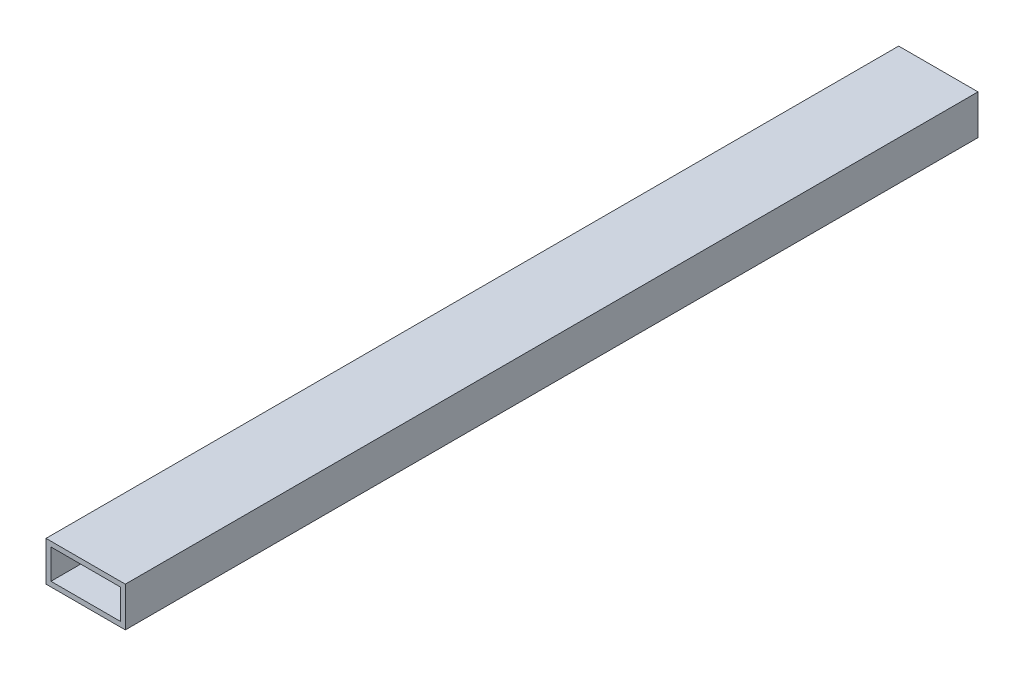
ISO-10303-21;
HEADER;
FILE_DESCRIPTION(('STEP AP214'),'2;1');
FILE_NAME('part.step','',(''),(''),'','','');
FILE_SCHEMA(('AUTOMOTIVE_DESIGN { 1 0 10303 214 1 1 1 1 }'));
ENDSEC;
DATA;
#1=APPLICATION_CONTEXT('core data for automotive mechanical design processes');
#2=APPLICATION_PROTOCOL_DEFINITION('international standard','automotive_design',2000,#1);
#3=PRODUCT_CONTEXT('',#1,'mechanical');
#4=PRODUCT('Part','Part','',(#3));
#5=PRODUCT_RELATED_PRODUCT_CATEGORY('part','',(#4));
#6=PRODUCT_DEFINITION_FORMATION('','',#4);
#7=PRODUCT_DEFINITION_CONTEXT('part definition',#1,'design');
#8=PRODUCT_DEFINITION('design','',#6,#7);
#9=PRODUCT_DEFINITION_SHAPE('','',#8);
#10=(LENGTH_UNIT() NAMED_UNIT(*) SI_UNIT(.MILLI.,.METRE.));
#11=(NAMED_UNIT(*) PLANE_ANGLE_UNIT() SI_UNIT($,.RADIAN.));
#12=(NAMED_UNIT(*) SI_UNIT($,.STERADIAN.) SOLID_ANGLE_UNIT());
#13=UNCERTAINTY_MEASURE_WITH_UNIT(LENGTH_MEASURE(1.E-05),#10,'distance_accuracy_value','');
#14=(GEOMETRIC_REPRESENTATION_CONTEXT(3) GLOBAL_UNCERTAINTY_ASSIGNED_CONTEXT((#13)) GLOBAL_UNIT_ASSIGNED_CONTEXT((#10,
#11,#12)) REPRESENTATION_CONTEXT('',''));
#15=CARTESIAN_POINT('',(0.,0.,0.));
#16=DIRECTION('',(0.,0.,1.));
#17=DIRECTION('',(1.,0.,0.));
#18=AXIS2_PLACEMENT_3D('',#15,#16,#17);
#19=CARTESIAN_POINT('',(0.,0.,546.1));
#20=DIRECTION('',(0.,0.,-1.));
#21=DIRECTION('',(-1.,0.,0.));
#22=AXIS2_PLACEMENT_3D('',#19,#20,#21);
#23=PLANE('',#22);
#24=DIRECTION('',(0.,-1.,0.));
#25=VECTOR('',#24,1.);
#26=CARTESIAN_POINT('',(0.,0.,546.1));
#27=LINE('',#26,#25);
#28=CARTESIAN_POINT('',(0.,25.4,546.1));
#29=VERTEX_POINT('',#28);
#30=CARTESIAN_POINT('',(0.,0.,546.1));
#31=VERTEX_POINT('',#30);
#32=EDGE_CURVE('E157',#29,#31,#27,.T.);
#33=ORIENTED_EDGE('',*,*,#32,.T.);
#34=DIRECTION('',(1.,0.,0.));
#35=VECTOR('',#34,1.);
#36=CARTESIAN_POINT('',(0.,0.,546.1));
#37=LINE('',#36,#35);
#38=CARTESIAN_POINT('',(50.8,0.,546.1));
#39=VERTEX_POINT('',#38);
#40=EDGE_CURVE('E161',#31,#39,#37,.T.);
#41=ORIENTED_EDGE('',*,*,#40,.T.);
#42=DIRECTION('',(0.,1.,0.));
#43=VECTOR('',#42,1.);
#44=CARTESIAN_POINT('',(50.8,0.,546.1));
#45=LINE('',#44,#43);
#46=CARTESIAN_POINT('',(50.8,25.4,546.1));
#47=VERTEX_POINT('',#46);
#48=EDGE_CURVE('E165',#39,#47,#45,.T.);
#49=ORIENTED_EDGE('',*,*,#48,.T.);
#50=DIRECTION('',(-1.,0.,0.));
#51=VECTOR('',#50,1.);
#52=CARTESIAN_POINT('',(0.,25.4,546.1));
#53=LINE('',#52,#51);
#54=EDGE_CURVE('E168',#47,#29,#53,.T.);
#55=ORIENTED_EDGE('',*,*,#54,.T.);
#56=EDGE_LOOP('',(#33,#41,#49,#55));
#57=FACE_BOUND('',#56,.T.);
#58=DIRECTION('',(0.,-1.,0.));
#59=VECTOR('',#58,1.);
#60=CARTESIAN_POINT('',(3.175,3.175,546.1));
#61=LINE('',#60,#59);
#62=CARTESIAN_POINT('',(3.175,22.225,546.1));
#63=VERTEX_POINT('',#62);
#64=CARTESIAN_POINT('',(3.175,3.175,546.1));
#65=VERTEX_POINT('',#64);
#66=EDGE_CURVE('E109',#63,#65,#61,.T.);
#67=ORIENTED_EDGE('',*,*,#66,.F.);
#68=DIRECTION('',(-1.,0.,0.));
#69=VECTOR('',#68,1.);
#70=CARTESIAN_POINT('',(3.175,22.225,546.1));
#71=LINE('',#70,#69);
#72=CARTESIAN_POINT('',(47.625,22.225,546.1));
#73=VERTEX_POINT('',#72);
#74=EDGE_CURVE('E135',#73,#63,#71,.T.);
#75=ORIENTED_EDGE('',*,*,#74,.F.);
#76=DIRECTION('',(0.,1.,0.));
#77=VECTOR('',#76,1.);
#78=CARTESIAN_POINT('',(47.625,3.175,546.1));
#79=LINE('',#78,#77);
#80=CARTESIAN_POINT('',(47.625,3.175,546.1));
#81=VERTEX_POINT('',#80);
#82=EDGE_CURVE('E131',#81,#73,#79,.T.);
#83=ORIENTED_EDGE('',*,*,#82,.F.);
#84=DIRECTION('',(1.,0.,0.));
#85=VECTOR('',#84,1.);
#86=CARTESIAN_POINT('',(3.175,3.175,546.1));
#87=LINE('',#86,#85);
#88=EDGE_CURVE('E118',#65,#81,#87,.T.);
#89=ORIENTED_EDGE('',*,*,#88,.F.);
#90=EDGE_LOOP('',(#67,#75,#83,#89));
#91=FACE_BOUND('',#90,.T.);
#92=ADVANCED_FACE('F43',(#57,#91),#23,.F.);
#93=CARTESIAN_POINT('',(0.,0.,0.));
#94=DIRECTION('',(0.,0.,-1.));
#95=DIRECTION('',(-1.,0.,0.));
#96=AXIS2_PLACEMENT_3D('',#93,#94,#95);
#97=PLANE('',#96);
#98=DIRECTION('',(0.,-1.,0.));
#99=VECTOR('',#98,1.);
#100=CARTESIAN_POINT('',(0.,0.,0.));
#101=LINE('',#100,#99);
#102=CARTESIAN_POINT('',(0.,25.4,0.));
#103=VERTEX_POINT('',#102);
#104=CARTESIAN_POINT('',(0.,0.,0.));
#105=VERTEX_POINT('',#104);
#106=EDGE_CURVE('E127',#103,#105,#101,.T.);
#107=ORIENTED_EDGE('',*,*,#106,.F.);
#108=DIRECTION('',(-1.,0.,0.));
#109=VECTOR('',#108,1.);
#110=CARTESIAN_POINT('',(0.,25.4,0.));
#111=LINE('',#110,#109);
#112=CARTESIAN_POINT('',(50.8,25.4,0.));
#113=VERTEX_POINT('',#112);
#114=EDGE_CURVE('E162',#113,#103,#111,.T.);
#115=ORIENTED_EDGE('',*,*,#114,.F.);
#116=DIRECTION('',(0.,1.,0.));
#117=VECTOR('',#116,1.);
#118=CARTESIAN_POINT('',(50.8,0.,0.));
#119=LINE('',#118,#117);
#120=CARTESIAN_POINT('',(50.8,0.,0.));
#121=VERTEX_POINT('',#120);
#122=EDGE_CURVE('E178',#121,#113,#119,.T.);
#123=ORIENTED_EDGE('',*,*,#122,.F.);
#124=DIRECTION('',(1.,0.,0.));
#125=VECTOR('',#124,1.);
#126=CARTESIAN_POINT('',(0.,0.,0.));
#127=LINE('',#126,#125);
#128=EDGE_CURVE('E175',#105,#121,#127,.T.);
#129=ORIENTED_EDGE('',*,*,#128,.F.);
#130=EDGE_LOOP('',(#107,#115,#123,#129));
#131=FACE_BOUND('',#130,.T.);
#132=DIRECTION('',(-1.,0.,0.));
#133=VECTOR('',#132,1.);
#134=CARTESIAN_POINT('',(3.175,22.225,0.));
#135=LINE('',#134,#133);
#136=CARTESIAN_POINT('',(47.625,22.225,0.));
#137=VERTEX_POINT('',#136);
#138=CARTESIAN_POINT('',(3.175,22.225,0.));
#139=VERTEX_POINT('',#138);
#140=EDGE_CURVE('E119',#137,#139,#135,.T.);
#141=ORIENTED_EDGE('',*,*,#140,.T.);
#142=DIRECTION('',(0.,-1.,0.));
#143=VECTOR('',#142,1.);
#144=CARTESIAN_POINT('',(3.175,3.175,0.));
#145=LINE('',#144,#143);
#146=CARTESIAN_POINT('',(3.175,3.175,0.));
#147=VERTEX_POINT('',#146);
#148=EDGE_CURVE('E67',#139,#147,#145,.T.);
#149=ORIENTED_EDGE('',*,*,#148,.T.);
#150=DIRECTION('',(1.,0.,0.));
#151=VECTOR('',#150,1.);
#152=CARTESIAN_POINT('',(3.175,3.175,0.));
#153=LINE('',#152,#151);
#154=CARTESIAN_POINT('',(47.625,3.175,0.));
#155=VERTEX_POINT('',#154);
#156=EDGE_CURVE('E125',#147,#155,#153,.T.);
#157=ORIENTED_EDGE('',*,*,#156,.T.);
#158=DIRECTION('',(0.,1.,0.));
#159=VECTOR('',#158,1.);
#160=CARTESIAN_POINT('',(47.625,3.175,0.));
#161=LINE('',#160,#159);
#162=EDGE_CURVE('E144',#155,#137,#161,.T.);
#163=ORIENTED_EDGE('',*,*,#162,.T.);
#164=EDGE_LOOP('',(#141,#149,#157,#163));
#165=FACE_BOUND('',#164,.T.);
#166=ADVANCED_FACE('F201',(#131,#165),#97,.T.);
#167=CARTESIAN_POINT('',(0.,0.,546.1));
#168=DIRECTION('',(1.,0.,0.));
#169=DIRECTION('',(0.,0.,-1.));
#170=AXIS2_PLACEMENT_3D('',#167,#168,#169);
#171=PLANE('',#170);
#172=ORIENTED_EDGE('',*,*,#106,.T.);
#173=DIRECTION('',(0.,0.,-1.));
#174=VECTOR('',#173,1.);
#175=CARTESIAN_POINT('',(0.,0.,546.1));
#176=LINE('',#175,#174);
#177=EDGE_CURVE('E11',#31,#105,#176,.T.);
#178=ORIENTED_EDGE('',*,*,#177,.F.);
#179=ORIENTED_EDGE('',*,*,#32,.F.);
#180=DIRECTION('',(0.,0.,-1.));
#181=VECTOR('',#180,1.);
#182=CARTESIAN_POINT('',(0.,25.4,546.1));
#183=LINE('',#182,#181);
#184=EDGE_CURVE('E171',#29,#103,#183,.T.);
#185=ORIENTED_EDGE('',*,*,#184,.T.);
#186=EDGE_LOOP('',(#172,#178,#179,#185));
#187=FACE_BOUND('',#186,.T.);
#188=ADVANCED_FACE('F45',(#187),#171,.F.);
#189=CARTESIAN_POINT('',(0.,0.,546.1));
#190=DIRECTION('',(0.,1.,0.));
#191=DIRECTION('',(0.,0.,1.));
#192=AXIS2_PLACEMENT_3D('',#189,#190,#191);
#193=PLANE('',#192);
#194=ORIENTED_EDGE('',*,*,#128,.T.);
#195=DIRECTION('',(0.,0.,-1.));
#196=VECTOR('',#195,1.);
#197=CARTESIAN_POINT('',(50.8,0.,546.1));
#198=LINE('',#197,#196);
#199=EDGE_CURVE('E52',#39,#121,#198,.T.);
#200=ORIENTED_EDGE('',*,*,#199,.F.);
#201=ORIENTED_EDGE('',*,*,#40,.F.);
#202=ORIENTED_EDGE('',*,*,#177,.T.);
#203=EDGE_LOOP('',(#194,#200,#201,#202));
#204=FACE_BOUND('',#203,.T.);
#205=ADVANCED_FACE('F211',(#204),#193,.F.);
#206=CARTESIAN_POINT('',(50.8,0.,546.1));
#207=DIRECTION('',(-1.,0.,0.));
#208=DIRECTION('',(0.,0.,1.));
#209=AXIS2_PLACEMENT_3D('',#206,#207,#208);
#210=PLANE('',#209);
#211=ORIENTED_EDGE('',*,*,#122,.T.);
#212=DIRECTION('',(0.,0.,-1.));
#213=VECTOR('',#212,1.);
#214=CARTESIAN_POINT('',(50.8,25.4,546.1));
#215=LINE('',#214,#213);
#216=EDGE_CURVE('E186',#47,#113,#215,.T.);
#217=ORIENTED_EDGE('',*,*,#216,.F.);
#218=ORIENTED_EDGE('',*,*,#48,.F.);
#219=ORIENTED_EDGE('',*,*,#199,.T.);
#220=EDGE_LOOP('',(#211,#217,#218,#219));
#221=FACE_BOUND('',#220,.T.);
#222=ADVANCED_FACE('F195',(#221),#210,.F.);
#223=CARTESIAN_POINT('',(0.,25.4,546.1));
#224=DIRECTION('',(0.,-1.,0.));
#225=DIRECTION('',(0.,0.,-1.));
#226=AXIS2_PLACEMENT_3D('',#223,#224,#225);
#227=PLANE('',#226);
#228=ORIENTED_EDGE('',*,*,#114,.T.);
#229=ORIENTED_EDGE('',*,*,#184,.F.);
#230=ORIENTED_EDGE('',*,*,#54,.F.);
#231=ORIENTED_EDGE('',*,*,#216,.T.);
#232=EDGE_LOOP('',(#228,#229,#230,#231));
#233=FACE_BOUND('',#232,.T.);
#234=ADVANCED_FACE('F205',(#233),#227,.F.);
#235=CARTESIAN_POINT('',(3.175,3.175,546.1));
#236=DIRECTION('',(1.,0.,0.));
#237=DIRECTION('',(0.,0.,-1.));
#238=AXIS2_PLACEMENT_3D('',#235,#236,#237);
#239=PLANE('',#238);
#240=ORIENTED_EDGE('',*,*,#148,.F.);
#241=DIRECTION('',(0.,0.,-1.));
#242=VECTOR('',#241,1.);
#243=CARTESIAN_POINT('',(3.175,22.225,546.1));
#244=LINE('',#243,#242);
#245=EDGE_CURVE('E113',#63,#139,#244,.T.);
#246=ORIENTED_EDGE('',*,*,#245,.F.);
#247=ORIENTED_EDGE('',*,*,#66,.T.);
#248=DIRECTION('',(0.,0.,-1.));
#249=VECTOR('',#248,1.);
#250=CARTESIAN_POINT('',(3.175,3.175,546.1));
#251=LINE('',#250,#249);
#252=EDGE_CURVE('E112',#65,#147,#251,.T.);
#253=ORIENTED_EDGE('',*,*,#252,.T.);
#254=EDGE_LOOP('',(#240,#246,#247,#253));
#255=FACE_BOUND('',#254,.T.);
#256=ADVANCED_FACE('F111',(#255),#239,.T.);
#257=CARTESIAN_POINT('',(3.175,3.175,546.1));
#258=DIRECTION('',(0.,1.,0.));
#259=DIRECTION('',(0.,0.,1.));
#260=AXIS2_PLACEMENT_3D('',#257,#258,#259);
#261=PLANE('',#260);
#262=ORIENTED_EDGE('',*,*,#156,.F.);
#263=ORIENTED_EDGE('',*,*,#252,.F.);
#264=ORIENTED_EDGE('',*,*,#88,.T.);
#265=DIRECTION('',(0.,0.,-1.));
#266=VECTOR('',#265,1.);
#267=CARTESIAN_POINT('',(47.625,3.175,546.1));
#268=LINE('',#267,#266);
#269=EDGE_CURVE('E128',#81,#155,#268,.T.);
#270=ORIENTED_EDGE('',*,*,#269,.T.);
#271=EDGE_LOOP('',(#262,#263,#264,#270));
#272=FACE_BOUND('',#271,.T.);
#273=ADVANCED_FACE('F122',(#272),#261,.T.);
#274=CARTESIAN_POINT('',(47.625,3.175,546.1));
#275=DIRECTION('',(-1.,0.,0.));
#276=DIRECTION('',(0.,0.,1.));
#277=AXIS2_PLACEMENT_3D('',#274,#275,#276);
#278=PLANE('',#277);
#279=ORIENTED_EDGE('',*,*,#162,.F.);
#280=ORIENTED_EDGE('',*,*,#269,.F.);
#281=ORIENTED_EDGE('',*,*,#82,.T.);
#282=DIRECTION('',(0.,0.,-1.));
#283=VECTOR('',#282,1.);
#284=CARTESIAN_POINT('',(47.625,22.225,546.1));
#285=LINE('',#284,#283);
#286=EDGE_CURVE('E59',#73,#137,#285,.T.);
#287=ORIENTED_EDGE('',*,*,#286,.T.);
#288=EDGE_LOOP('',(#279,#280,#281,#287));
#289=FACE_BOUND('',#288,.T.);
#290=ADVANCED_FACE('F234',(#289),#278,.T.);
#291=CARTESIAN_POINT('',(3.175,22.225,546.1));
#292=DIRECTION('',(0.,-1.,0.));
#293=DIRECTION('',(0.,0.,-1.));
#294=AXIS2_PLACEMENT_3D('',#291,#292,#293);
#295=PLANE('',#294);
#296=ORIENTED_EDGE('',*,*,#140,.F.);
#297=ORIENTED_EDGE('',*,*,#286,.F.);
#298=ORIENTED_EDGE('',*,*,#74,.T.);
#299=ORIENTED_EDGE('',*,*,#245,.T.);
#300=EDGE_LOOP('',(#296,#297,#298,#299));
#301=FACE_BOUND('',#300,.T.);
#302=ADVANCED_FACE('F238',(#301),#295,.T.);
#303=CLOSED_SHELL('',(#92,#166,#188,#205,#222,#234,#256,#273,#290,#302));
#304=MANIFOLD_SOLID_BREP('B2',#303);
#305=ADVANCED_BREP_SHAPE_REPRESENTATION('',(#18,#304),#14);
#306=SHAPE_DEFINITION_REPRESENTATION(#9,#305);
ENDSEC;
END-ISO-10303-21;
